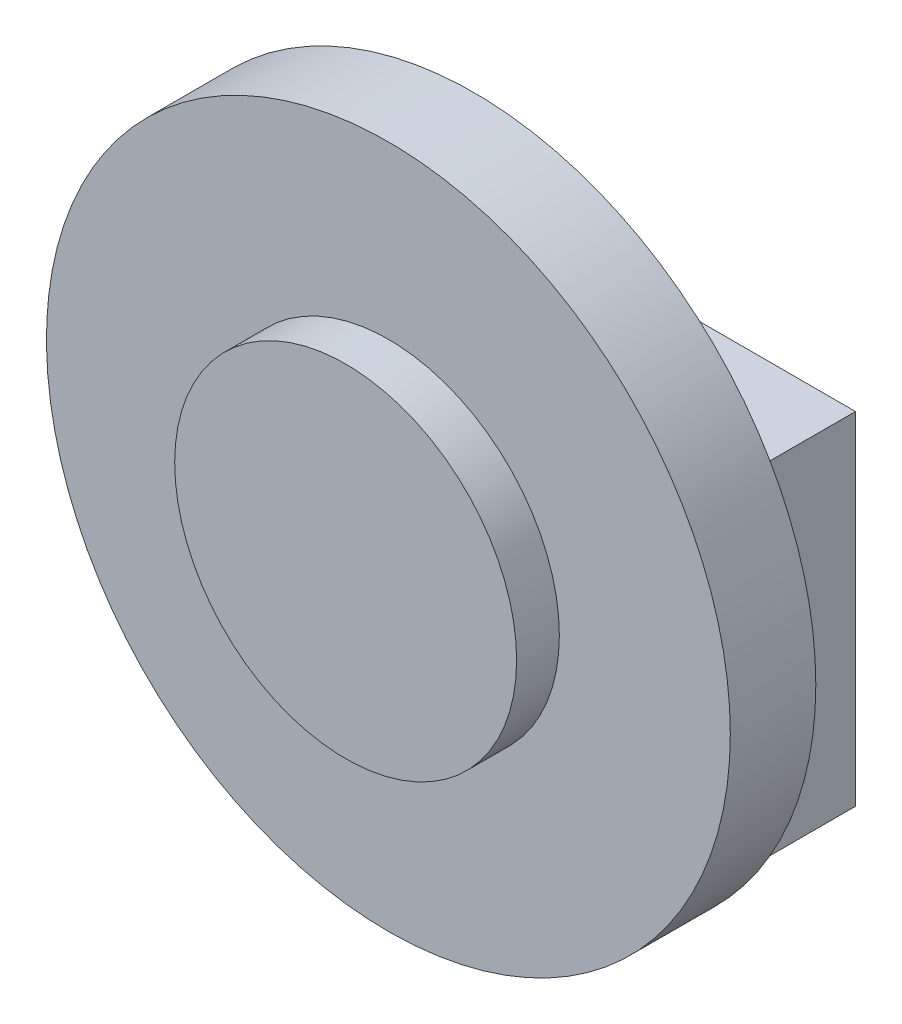
ISO-10303-21;
HEADER;
FILE_DESCRIPTION(('STEP AP214'),'2;1');
FILE_NAME('part.step','',(''),(''),'','','');
FILE_SCHEMA(('AUTOMOTIVE_DESIGN { 1 0 10303 214 1 1 1 1 }'));
ENDSEC;
DATA;
#1=APPLICATION_CONTEXT('core data for automotive mechanical design processes');
#2=APPLICATION_PROTOCOL_DEFINITION('international standard','automotive_design',2000,#1);
#3=PRODUCT_CONTEXT('',#1,'mechanical');
#4=PRODUCT('Part','Part','',(#3));
#5=PRODUCT_RELATED_PRODUCT_CATEGORY('part','',(#4));
#6=PRODUCT_DEFINITION_FORMATION('','',#4);
#7=PRODUCT_DEFINITION_CONTEXT('part definition',#1,'design');
#8=PRODUCT_DEFINITION('design','',#6,#7);
#9=PRODUCT_DEFINITION_SHAPE('','',#8);
#10=(LENGTH_UNIT() NAMED_UNIT(*) SI_UNIT(.MILLI.,.METRE.));
#11=(NAMED_UNIT(*) PLANE_ANGLE_UNIT() SI_UNIT($,.RADIAN.));
#12=(NAMED_UNIT(*) SI_UNIT($,.STERADIAN.) SOLID_ANGLE_UNIT());
#13=UNCERTAINTY_MEASURE_WITH_UNIT(LENGTH_MEASURE(1.E-05),#10,'distance_accuracy_value','');
#14=(GEOMETRIC_REPRESENTATION_CONTEXT(3) GLOBAL_UNCERTAINTY_ASSIGNED_CONTEXT((#13)) GLOBAL_UNIT_ASSIGNED_CONTEXT((#10,
#11,#12)) REPRESENTATION_CONTEXT('',''));
#15=CARTESIAN_POINT('',(0.,0.,0.));
#16=DIRECTION('',(0.,0.,1.));
#17=DIRECTION('',(1.,0.,0.));
#18=AXIS2_PLACEMENT_3D('',#15,#16,#17);
#19=CARTESIAN_POINT('',(0.,0.,0.));
#20=DIRECTION('',(0.,0.,1.));
#21=DIRECTION('',(1.,0.,0.));
#22=AXIS2_PLACEMENT_3D('',#19,#20,#21);
#23=PLANE('',#22);
#24=DIRECTION('',(0.,1.,0.));
#25=VECTOR('',#24,1.);
#26=CARTESIAN_POINT('',(-3.46410161513775,-2.,0.));
#27=LINE('',#26,#25);
#28=CARTESIAN_POINT('',(-3.46410161513775,-2.,0.));
#29=VERTEX_POINT('',#28);
#30=CARTESIAN_POINT('',(-3.46410161513775,2.,0.));
#31=VERTEX_POINT('',#30);
#32=EDGE_CURVE('E67',#29,#31,#27,.T.);
#33=ORIENTED_EDGE('',*,*,#32,.F.);
#34=CARTESIAN_POINT('',(0.,0.,0.));
#35=DIRECTION('',(0.,0.,1.));
#36=DIRECTION('',(1.,0.,0.));
#37=AXIS2_PLACEMENT_3D('',#34,#35,#36);
#38=CIRCLE('',#37,4.);
#39=EDGE_CURVE('E129',#31,#29,#38,.T.);
#40=ORIENTED_EDGE('',*,*,#39,.F.);
#41=EDGE_LOOP('',(#33,#40));
#42=FACE_BOUND('',#41,.T.);
#43=ADVANCED_FACE('F43',(#42),#23,.F.);
#44=DIRECTION('',(-1.,0.,0.));
#45=VECTOR('',#44,1.);
#46=CARTESIAN_POINT('',(3.46410161513775,-2.,0.));
#47=LINE('',#46,#45);
#48=CARTESIAN_POINT('',(3.46410161513775,-2.,0.));
#49=VERTEX_POINT('',#48);
#50=EDGE_CURVE('E60',#49,#29,#47,.T.);
#51=ORIENTED_EDGE('',*,*,#50,.F.);
#52=EDGE_CURVE('E134',#29,#49,#38,.T.);
#53=ORIENTED_EDGE('',*,*,#52,.F.);
#54=EDGE_LOOP('',(#51,#53));
#55=FACE_BOUND('',#54,.T.);
#56=ADVANCED_FACE('F168',(#55),#23,.F.);
#57=DIRECTION('',(0.,-1.,0.));
#58=VECTOR('',#57,1.);
#59=CARTESIAN_POINT('',(3.46410161513775,-2.,0.));
#60=LINE('',#59,#58);
#61=CARTESIAN_POINT('',(3.46410161513775,2.,0.));
#62=VERTEX_POINT('',#61);
#63=EDGE_CURVE('E142',#62,#49,#60,.T.);
#64=ORIENTED_EDGE('',*,*,#63,.F.);
#65=EDGE_CURVE('E118',#49,#62,#38,.T.);
#66=ORIENTED_EDGE('',*,*,#65,.F.);
#67=EDGE_LOOP('',(#64,#66));
#68=FACE_BOUND('',#67,.T.);
#69=ADVANCED_FACE('F172',(#68),#23,.F.);
#70=DIRECTION('',(1.,0.,0.));
#71=VECTOR('',#70,1.);
#72=CARTESIAN_POINT('',(3.46410161513775,2.,0.));
#73=LINE('',#72,#71);
#74=EDGE_CURVE('E147',#31,#62,#73,.T.);
#75=ORIENTED_EDGE('',*,*,#74,.F.);
#76=EDGE_CURVE('E47',#62,#31,#38,.T.);
#77=ORIENTED_EDGE('',*,*,#76,.F.);
#78=EDGE_LOOP('',(#75,#77));
#79=FACE_BOUND('',#78,.T.);
#80=ADVANCED_FACE('F166',(#79),#23,.F.);
#81=CARTESIAN_POINT('',(0.,0.,1.));
#82=DIRECTION('',(0.,0.,-1.));
#83=DIRECTION('',(-1.,0.,0.));
#84=AXIS2_PLACEMENT_3D('',#81,#82,#83);
#85=CYLINDRICAL_SURFACE('',#84,4.);
#86=CARTESIAN_POINT('',(0.,0.,1.));
#87=DIRECTION('',(0.,0.,1.));
#88=DIRECTION('',(1.,0.,0.));
#89=AXIS2_PLACEMENT_3D('',#86,#87,#88);
#90=CIRCLE('',#89,4.);
#91=CARTESIAN_POINT('',(4.,0.,1.));
#92=VERTEX_POINT('',#91);
#93=EDGE_CURVE('E53',#92,#92,#90,.T.);
#94=ORIENTED_EDGE('',*,*,#93,.F.);
#95=EDGE_LOOP('',(#94));
#96=FACE_BOUND('',#95,.T.);
#97=ORIENTED_EDGE('',*,*,#76,.T.);
#98=ORIENTED_EDGE('',*,*,#39,.T.);
#99=ORIENTED_EDGE('',*,*,#52,.T.);
#100=ORIENTED_EDGE('',*,*,#65,.T.);
#101=EDGE_LOOP('',(#97,#98,#99,#100));
#102=FACE_BOUND('',#101,.T.);
#103=ADVANCED_FACE('F45',(#96,#102),#85,.T.);
#104=CARTESIAN_POINT('',(0.,0.,1.));
#105=DIRECTION('',(0.,0.,1.));
#106=DIRECTION('',(1.,0.,0.));
#107=AXIS2_PLACEMENT_3D('',#104,#105,#106);
#108=PLANE('',#107);
#109=CARTESIAN_POINT('',(0.,0.,1.));
#110=DIRECTION('',(0.,0.,1.));
#111=DIRECTION('',(1.,0.,0.));
#112=AXIS2_PLACEMENT_3D('',#109,#110,#111);
#113=CIRCLE('',#112,2.);
#114=CARTESIAN_POINT('',(2.,0.,1.));
#115=VERTEX_POINT('',#114);
#116=EDGE_CURVE('E11',#115,#115,#113,.T.);
#117=ORIENTED_EDGE('',*,*,#116,.F.);
#118=EDGE_LOOP('',(#117));
#119=FACE_BOUND('',#118,.T.);
#120=ORIENTED_EDGE('',*,*,#93,.T.);
#121=EDGE_LOOP('',(#120));
#122=FACE_BOUND('',#121,.T.);
#123=ADVANCED_FACE('F179',(#119,#122),#108,.T.);
#124=CARTESIAN_POINT('',(0.,0.,1.5));
#125=DIRECTION('',(0.,0.,-1.));
#126=DIRECTION('',(-1.,0.,0.));
#127=AXIS2_PLACEMENT_3D('',#124,#125,#126);
#128=CYLINDRICAL_SURFACE('',#127,2.);
#129=CARTESIAN_POINT('',(0.,0.,1.5));
#130=DIRECTION('',(0.,0.,1.));
#131=DIRECTION('',(1.,0.,0.));
#132=AXIS2_PLACEMENT_3D('',#129,#130,#131);
#133=CIRCLE('',#132,2.);
#134=CARTESIAN_POINT('',(2.,0.,1.5));
#135=VERTEX_POINT('',#134);
#136=EDGE_CURVE('E113',#135,#135,#133,.T.);
#137=ORIENTED_EDGE('',*,*,#136,.F.);
#138=EDGE_LOOP('',(#137));
#139=FACE_BOUND('',#138,.T.);
#140=ORIENTED_EDGE('',*,*,#116,.T.);
#141=EDGE_LOOP('',(#140));
#142=FACE_BOUND('',#141,.T.);
#143=ADVANCED_FACE('F202',(#139,#142),#128,.T.);
#144=CARTESIAN_POINT('',(0.,0.,1.5));
#145=DIRECTION('',(0.,0.,1.));
#146=DIRECTION('',(1.,0.,0.));
#147=AXIS2_PLACEMENT_3D('',#144,#145,#146);
#148=PLANE('',#147);
#149=ORIENTED_EDGE('',*,*,#136,.T.);
#150=EDGE_LOOP('',(#149));
#151=FACE_BOUND('',#150,.T.);
#152=ADVANCED_FACE('F197',(#151),#148,.T.);
#153=CARTESIAN_POINT('',(-3.46410161513775,-2.,-1.));
#154=DIRECTION('',(1.,0.,0.));
#155=DIRECTION('',(0.,0.,-1.));
#156=AXIS2_PLACEMENT_3D('',#153,#154,#155);
#157=PLANE('',#156);
#158=ORIENTED_EDGE('',*,*,#32,.T.);
#159=DIRECTION('',(0.,0.,1.));
#160=VECTOR('',#159,1.);
#161=CARTESIAN_POINT('',(-3.46410161513775,2.,-1.));
#162=LINE('',#161,#160);
#163=CARTESIAN_POINT('',(-3.46410161513775,2.,-1.));
#164=VERTEX_POINT('',#163);
#165=EDGE_CURVE('E93',#164,#31,#162,.T.);
#166=ORIENTED_EDGE('',*,*,#165,.F.);
#167=DIRECTION('',(0.,1.,0.));
#168=VECTOR('',#167,1.);
#169=CARTESIAN_POINT('',(-3.46410161513775,-2.,-1.));
#170=LINE('',#169,#168);
#171=CARTESIAN_POINT('',(-3.46410161513775,-2.,-1.));
#172=VERTEX_POINT('',#171);
#173=EDGE_CURVE('E100',#172,#164,#170,.T.);
#174=ORIENTED_EDGE('',*,*,#173,.F.);
#175=DIRECTION('',(0.,0.,1.));
#176=VECTOR('',#175,1.);
#177=CARTESIAN_POINT('',(-3.46410161513775,-2.,-1.));
#178=LINE('',#177,#176);
#179=EDGE_CURVE('E152',#172,#29,#178,.T.);
#180=ORIENTED_EDGE('',*,*,#179,.T.);
#181=EDGE_LOOP('',(#158,#166,#174,#180));
#182=FACE_BOUND('',#181,.T.);
#183=ADVANCED_FACE('F111',(#182),#157,.F.);
#184=CARTESIAN_POINT('',(3.46410161513775,2.,-1.));
#185=DIRECTION('',(0.,-1.,0.));
#186=DIRECTION('',(0.,0.,-1.));
#187=AXIS2_PLACEMENT_3D('',#184,#185,#186);
#188=PLANE('',#187);
#189=ORIENTED_EDGE('',*,*,#74,.T.);
#190=DIRECTION('',(0.,0.,1.));
#191=VECTOR('',#190,1.);
#192=CARTESIAN_POINT('',(3.46410161513775,2.,-1.));
#193=LINE('',#192,#191);
#194=CARTESIAN_POINT('',(3.46410161513775,2.,-1.));
#195=VERTEX_POINT('',#194);
#196=EDGE_CURVE('E95',#195,#62,#193,.T.);
#197=ORIENTED_EDGE('',*,*,#196,.F.);
#198=DIRECTION('',(1.,0.,0.));
#199=VECTOR('',#198,1.);
#200=CARTESIAN_POINT('',(3.46410161513775,2.,-1.));
#201=LINE('',#200,#199);
#202=EDGE_CURVE('E88',#164,#195,#201,.T.);
#203=ORIENTED_EDGE('',*,*,#202,.F.);
#204=ORIENTED_EDGE('',*,*,#165,.T.);
#205=EDGE_LOOP('',(#189,#197,#203,#204));
#206=FACE_BOUND('',#205,.T.);
#207=ADVANCED_FACE('F91',(#206),#188,.F.);
#208=CARTESIAN_POINT('',(3.46410161513775,-2.,-1.));
#209=DIRECTION('',(-1.,0.,0.));
#210=DIRECTION('',(0.,0.,1.));
#211=AXIS2_PLACEMENT_3D('',#208,#209,#210);
#212=PLANE('',#211);
#213=ORIENTED_EDGE('',*,*,#63,.T.);
#214=DIRECTION('',(0.,0.,1.));
#215=VECTOR('',#214,1.);
#216=CARTESIAN_POINT('',(3.46410161513775,-2.,-1.));
#217=LINE('',#216,#215);
#218=CARTESIAN_POINT('',(3.46410161513775,-2.,-1.));
#219=VERTEX_POINT('',#218);
#220=EDGE_CURVE('E120',#219,#49,#217,.T.);
#221=ORIENTED_EDGE('',*,*,#220,.F.);
#222=DIRECTION('',(0.,-1.,0.));
#223=VECTOR('',#222,1.);
#224=CARTESIAN_POINT('',(3.46410161513775,-2.,-1.));
#225=LINE('',#224,#223);
#226=EDGE_CURVE('E99',#195,#219,#225,.T.);
#227=ORIENTED_EDGE('',*,*,#226,.F.);
#228=ORIENTED_EDGE('',*,*,#196,.T.);
#229=EDGE_LOOP('',(#213,#221,#227,#228));
#230=FACE_BOUND('',#229,.T.);
#231=ADVANCED_FACE('F144',(#230),#212,.F.);
#232=CARTESIAN_POINT('',(3.46410161513775,-2.,-1.));
#233=DIRECTION('',(0.,1.,0.));
#234=DIRECTION('',(0.,0.,1.));
#235=AXIS2_PLACEMENT_3D('',#232,#233,#234);
#236=PLANE('',#235);
#237=ORIENTED_EDGE('',*,*,#50,.T.);
#238=ORIENTED_EDGE('',*,*,#179,.F.);
#239=DIRECTION('',(-1.,0.,0.));
#240=VECTOR('',#239,1.);
#241=CARTESIAN_POINT('',(3.46410161513775,-2.,-1.));
#242=LINE('',#241,#240);
#243=EDGE_CURVE('E105',#219,#172,#242,.T.);
#244=ORIENTED_EDGE('',*,*,#243,.F.);
#245=ORIENTED_EDGE('',*,*,#220,.T.);
#246=EDGE_LOOP('',(#237,#238,#244,#245));
#247=FACE_BOUND('',#246,.T.);
#248=ADVANCED_FACE('F150',(#247),#236,.F.);
#249=CARTESIAN_POINT('',(0.,0.,-1.));
#250=DIRECTION('',(0.,0.,1.));
#251=DIRECTION('',(1.,0.,0.));
#252=AXIS2_PLACEMENT_3D('',#249,#250,#251);
#253=PLANE('',#252);
#254=ORIENTED_EDGE('',*,*,#173,.T.);
#255=ORIENTED_EDGE('',*,*,#202,.T.);
#256=ORIENTED_EDGE('',*,*,#226,.T.);
#257=ORIENTED_EDGE('',*,*,#243,.T.);
#258=EDGE_LOOP('',(#254,#255,#256,#257));
#259=FACE_BOUND('',#258,.T.);
#260=ADVANCED_FACE('F103',(#259),#253,.F.);
#261=CLOSED_SHELL('',(#43,#56,#69,#80,#103,#123,#143,#152,#183,#207,#231,#248,#260));
#262=MANIFOLD_SOLID_BREP('B2',#261);
#263=ADVANCED_BREP_SHAPE_REPRESENTATION('',(#18,#262),#14);
#264=SHAPE_DEFINITION_REPRESENTATION(#9,#263);
ENDSEC;
END-ISO-10303-21;
